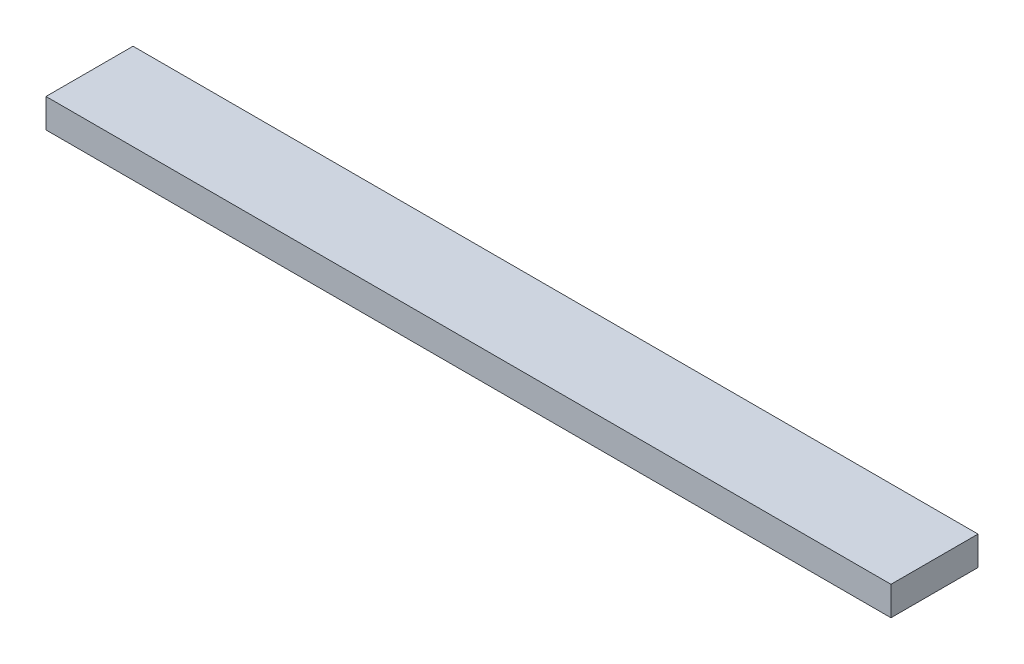
ISO-10303-21;
HEADER;
FILE_DESCRIPTION(('STEP AP214'),'2;1');
FILE_NAME('part.step','',(''),(''),'','','');
FILE_SCHEMA(('AUTOMOTIVE_DESIGN { 1 0 10303 214 1 1 1 1 }'));
ENDSEC;
DATA;
#1=APPLICATION_CONTEXT('core data for automotive mechanical design processes');
#2=APPLICATION_PROTOCOL_DEFINITION('international standard','automotive_design',2000,#1);
#3=PRODUCT_CONTEXT('',#1,'mechanical');
#4=PRODUCT('Part','Part','',(#3));
#5=PRODUCT_RELATED_PRODUCT_CATEGORY('part','',(#4));
#6=PRODUCT_DEFINITION_FORMATION('','',#4);
#7=PRODUCT_DEFINITION_CONTEXT('part definition',#1,'design');
#8=PRODUCT_DEFINITION('design','',#6,#7);
#9=PRODUCT_DEFINITION_SHAPE('','',#8);
#10=(LENGTH_UNIT() NAMED_UNIT(*) SI_UNIT(.MILLI.,.METRE.));
#11=(NAMED_UNIT(*) PLANE_ANGLE_UNIT() SI_UNIT($,.RADIAN.));
#12=(NAMED_UNIT(*) SI_UNIT($,.STERADIAN.) SOLID_ANGLE_UNIT());
#13=UNCERTAINTY_MEASURE_WITH_UNIT(LENGTH_MEASURE(1.E-05),#10,'distance_accuracy_value','');
#14=(GEOMETRIC_REPRESENTATION_CONTEXT(3) GLOBAL_UNCERTAINTY_ASSIGNED_CONTEXT((#13)) GLOBAL_UNIT_ASSIGNED_CONTEXT((#10,
#11,#12)) REPRESENTATION_CONTEXT('',''));
#15=CARTESIAN_POINT('',(0.,0.,0.));
#16=DIRECTION('',(0.,0.,1.));
#17=DIRECTION('',(1.,0.,0.));
#18=AXIS2_PLACEMENT_3D('',#15,#16,#17);
#19=CARTESIAN_POINT('',(291.254147161365,20.,-30.));
#20=DIRECTION('',(-1.,0.,0.));
#21=DIRECTION('',(0.,0.,1.));
#22=AXIS2_PLACEMENT_3D('',#19,#20,#21);
#23=PLANE('',#22);
#24=DIRECTION('',(0.,0.,-1.));
#25=VECTOR('',#24,1.);
#26=CARTESIAN_POINT('',(291.254147161365,0.,-30.));
#27=LINE('',#26,#25);
#28=CARTESIAN_POINT('',(291.254147161365,0.,30.));
#29=VERTEX_POINT('',#28);
#30=CARTESIAN_POINT('',(291.254147161365,0.,-30.));
#31=VERTEX_POINT('',#30);
#32=EDGE_CURVE('E96',#29,#31,#27,.T.);
#33=ORIENTED_EDGE('',*,*,#32,.T.);
#34=DIRECTION('',(0.,-1.,0.));
#35=VECTOR('',#34,1.);
#36=CARTESIAN_POINT('',(291.254147161365,20.,-30.));
#37=LINE('',#36,#35);
#38=CARTESIAN_POINT('',(291.254147161365,20.,-30.));
#39=VERTEX_POINT('',#38);
#40=EDGE_CURVE('E11',#39,#31,#37,.T.);
#41=ORIENTED_EDGE('',*,*,#40,.F.);
#42=DIRECTION('',(0.,0.,-1.));
#43=VECTOR('',#42,1.);
#44=CARTESIAN_POINT('',(291.254147161365,20.,-30.));
#45=LINE('',#44,#43);
#46=CARTESIAN_POINT('',(291.254147161365,20.,30.));
#47=VERTEX_POINT('',#46);
#48=EDGE_CURVE('E84',#47,#39,#45,.T.);
#49=ORIENTED_EDGE('',*,*,#48,.F.);
#50=DIRECTION('',(0.,-1.,0.));
#51=VECTOR('',#50,1.);
#52=CARTESIAN_POINT('',(291.254147161365,20.,30.));
#53=LINE('',#52,#51);
#54=EDGE_CURVE('E92',#47,#29,#53,.T.);
#55=ORIENTED_EDGE('',*,*,#54,.T.);
#56=EDGE_LOOP('',(#33,#41,#49,#55));
#57=FACE_BOUND('',#56,.T.);
#58=ADVANCED_FACE('F33',(#57),#23,.F.);
#59=CARTESIAN_POINT('',(-291.254147161366,20.,-30.));
#60=DIRECTION('',(0.,0.,1.));
#61=DIRECTION('',(1.,0.,0.));
#62=AXIS2_PLACEMENT_3D('',#59,#60,#61);
#63=PLANE('',#62);
#64=DIRECTION('',(-1.,0.,0.));
#65=VECTOR('',#64,1.);
#66=CARTESIAN_POINT('',(-291.254147161366,0.,-30.));
#67=LINE('',#66,#65);
#68=CARTESIAN_POINT('',(-291.254147161366,0.,-30.));
#69=VERTEX_POINT('',#68);
#70=EDGE_CURVE('E88',#31,#69,#67,.T.);
#71=ORIENTED_EDGE('',*,*,#70,.T.);
#72=DIRECTION('',(0.,-1.,0.));
#73=VECTOR('',#72,1.);
#74=CARTESIAN_POINT('',(-291.254147161366,20.,-30.));
#75=LINE('',#74,#73);
#76=CARTESIAN_POINT('',(-291.254147161366,20.,-30.));
#77=VERTEX_POINT('',#76);
#78=EDGE_CURVE('E41',#77,#69,#75,.T.);
#79=ORIENTED_EDGE('',*,*,#78,.F.);
#80=DIRECTION('',(-1.,0.,0.));
#81=VECTOR('',#80,1.);
#82=CARTESIAN_POINT('',(-291.254147161366,20.,-30.));
#83=LINE('',#82,#81);
#84=EDGE_CURVE('E79',#39,#77,#83,.T.);
#85=ORIENTED_EDGE('',*,*,#84,.F.);
#86=ORIENTED_EDGE('',*,*,#40,.T.);
#87=EDGE_LOOP('',(#71,#79,#85,#86));
#88=FACE_BOUND('',#87,.T.);
#89=ADVANCED_FACE('F87',(#88),#63,.F.);
#90=CARTESIAN_POINT('',(-291.254147161366,20.,-30.));
#91=DIRECTION('',(1.,0.,0.));
#92=DIRECTION('',(0.,0.,-1.));
#93=AXIS2_PLACEMENT_3D('',#90,#91,#92);
#94=PLANE('',#93);
#95=DIRECTION('',(0.,0.,1.));
#96=VECTOR('',#95,1.);
#97=CARTESIAN_POINT('',(-291.254147161366,0.,-30.));
#98=LINE('',#97,#96);
#99=CARTESIAN_POINT('',(-291.254147161366,0.,30.));
#100=VERTEX_POINT('',#99);
#101=EDGE_CURVE('E66',#69,#100,#98,.T.);
#102=ORIENTED_EDGE('',*,*,#101,.T.);
#103=DIRECTION('',(0.,-1.,0.));
#104=VECTOR('',#103,1.);
#105=CARTESIAN_POINT('',(-291.254147161366,20.,30.));
#106=LINE('',#105,#104);
#107=CARTESIAN_POINT('',(-291.254147161366,20.,30.));
#108=VERTEX_POINT('',#107);
#109=EDGE_CURVE('E89',#108,#100,#106,.T.);
#110=ORIENTED_EDGE('',*,*,#109,.F.);
#111=DIRECTION('',(0.,0.,1.));
#112=VECTOR('',#111,1.);
#113=CARTESIAN_POINT('',(-291.254147161366,20.,-30.));
#114=LINE('',#113,#112);
#115=EDGE_CURVE('E82',#77,#108,#114,.T.);
#116=ORIENTED_EDGE('',*,*,#115,.F.);
#117=ORIENTED_EDGE('',*,*,#78,.T.);
#118=EDGE_LOOP('',(#102,#110,#116,#117));
#119=FACE_BOUND('',#118,.T.);
#120=ADVANCED_FACE('F90',(#119),#94,.F.);
#121=CARTESIAN_POINT('',(-291.254147161366,20.,30.));
#122=DIRECTION('',(0.,0.,-1.));
#123=DIRECTION('',(-1.,0.,0.));
#124=AXIS2_PLACEMENT_3D('',#121,#122,#123);
#125=PLANE('',#124);
#126=DIRECTION('',(1.,0.,0.));
#127=VECTOR('',#126,1.);
#128=CARTESIAN_POINT('',(-291.254147161366,0.,30.));
#129=LINE('',#128,#127);
#130=EDGE_CURVE('E72',#100,#29,#129,.T.);
#131=ORIENTED_EDGE('',*,*,#130,.T.);
#132=ORIENTED_EDGE('',*,*,#54,.F.);
#133=DIRECTION('',(1.,0.,0.));
#134=VECTOR('',#133,1.);
#135=CARTESIAN_POINT('',(-291.254147161366,20.,30.));
#136=LINE('',#135,#134);
#137=EDGE_CURVE('E49',#108,#47,#136,.T.);
#138=ORIENTED_EDGE('',*,*,#137,.F.);
#139=ORIENTED_EDGE('',*,*,#109,.T.);
#140=EDGE_LOOP('',(#131,#132,#138,#139));
#141=FACE_BOUND('',#140,.T.);
#142=ADVANCED_FACE('F103',(#141),#125,.F.);
#143=CARTESIAN_POINT('',(0.,20.,0.));
#144=DIRECTION('',(0.,1.,0.));
#145=DIRECTION('',(0.,0.,1.));
#146=AXIS2_PLACEMENT_3D('',#143,#144,#145);
#147=PLANE('',#146);
#148=ORIENTED_EDGE('',*,*,#48,.T.);
#149=ORIENTED_EDGE('',*,*,#84,.T.);
#150=ORIENTED_EDGE('',*,*,#115,.T.);
#151=ORIENTED_EDGE('',*,*,#137,.T.);
#152=EDGE_LOOP('',(#148,#149,#150,#151));
#153=FACE_BOUND('',#152,.T.);
#154=ADVANCED_FACE('F80',(#153),#147,.T.);
#155=CARTESIAN_POINT('',(0.,0.,0.));
#156=DIRECTION('',(0.,1.,0.));
#157=DIRECTION('',(0.,0.,1.));
#158=AXIS2_PLACEMENT_3D('',#155,#156,#157);
#159=PLANE('',#158);
#160=ORIENTED_EDGE('',*,*,#32,.F.);
#161=ORIENTED_EDGE('',*,*,#130,.F.);
#162=ORIENTED_EDGE('',*,*,#101,.F.);
#163=ORIENTED_EDGE('',*,*,#70,.F.);
#164=EDGE_LOOP('',(#160,#161,#162,#163));
#165=FACE_BOUND('',#164,.T.);
#166=ADVANCED_FACE('F106',(#165),#159,.F.);
#167=CLOSED_SHELL('',(#58,#89,#120,#142,#154,#166));
#168=MANIFOLD_SOLID_BREP('B2',#167);
#169=ADVANCED_BREP_SHAPE_REPRESENTATION('',(#18,#168),#14);
#170=SHAPE_DEFINITION_REPRESENTATION(#9,#169);
ENDSEC;
END-ISO-10303-21;
